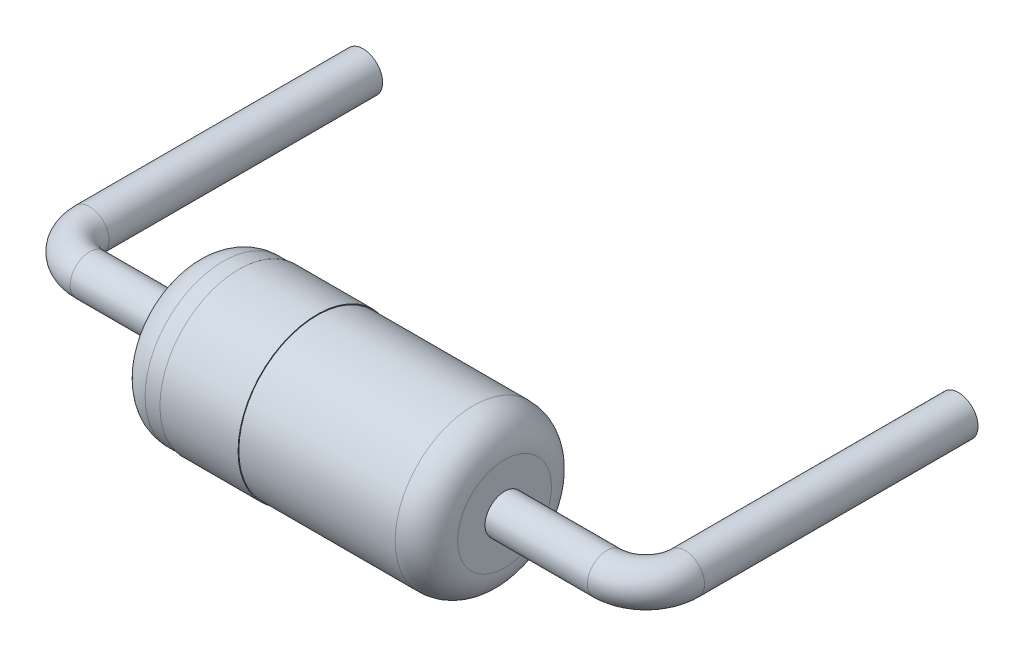
ISO-10303-21;
HEADER;
FILE_DESCRIPTION(('STEP AP214'),'2;1');
FILE_NAME('part.step','',(''),(''),'','','');
FILE_SCHEMA(('AUTOMOTIVE_DESIGN { 1 0 10303 214 1 1 1 1 }'));
ENDSEC;
DATA;
#1=APPLICATION_CONTEXT('core data for automotive mechanical design processes');
#2=APPLICATION_PROTOCOL_DEFINITION('international standard','automotive_design',2000,#1);
#3=PRODUCT_CONTEXT('',#1,'mechanical');
#4=PRODUCT('Part','Part','',(#3));
#5=PRODUCT_RELATED_PRODUCT_CATEGORY('part','',(#4));
#6=PRODUCT_DEFINITION_FORMATION('','',#4);
#7=PRODUCT_DEFINITION_CONTEXT('part definition',#1,'design');
#8=PRODUCT_DEFINITION('design','',#6,#7);
#9=PRODUCT_DEFINITION_SHAPE('','',#8);
#10=(LENGTH_UNIT() NAMED_UNIT(*) SI_UNIT(.MILLI.,.METRE.));
#11=(NAMED_UNIT(*) PLANE_ANGLE_UNIT() SI_UNIT($,.RADIAN.));
#12=(NAMED_UNIT(*) SI_UNIT($,.STERADIAN.) SOLID_ANGLE_UNIT());
#13=UNCERTAINTY_MEASURE_WITH_UNIT(LENGTH_MEASURE(1.E-05),#10,'distance_accuracy_value','');
#14=(GEOMETRIC_REPRESENTATION_CONTEXT(3) GLOBAL_UNCERTAINTY_ASSIGNED_CONTEXT((#13)) GLOBAL_UNIT_ASSIGNED_CONTEXT((#10,
#11,#12)) REPRESENTATION_CONTEXT('',''));
#15=CARTESIAN_POINT('',(0.,0.,0.));
#16=DIRECTION('',(0.,0.,1.));
#17=DIRECTION('',(1.,0.,0.));
#18=AXIS2_PLACEMENT_3D('',#15,#16,#17);
#19=CARTESIAN_POINT('',(7.37,0.,-2.5));
#20=DIRECTION('',(0.,0.,1.));
#21=DIRECTION('',(1.,0.,0.));
#22=AXIS2_PLACEMENT_3D('',#19,#20,#21);
#23=PLANE('',#22);
#24=CARTESIAN_POINT('',(7.62,0.,-2.5));
#25=DIRECTION('',(0.,0.,-1.));
#26=DIRECTION('',(-1.,0.,0.));
#27=AXIS2_PLACEMENT_3D('',#24,#25,#26);
#28=CIRCLE('',#27,0.25);
#29=CARTESIAN_POINT('',(7.37,0.,-2.5));
#30=VERTEX_POINT('',#29);
#31=EDGE_CURVE('P0_E11',#30,#30,#28,.T.);
#32=ORIENTED_EDGE('',*,*,#31,.T.);
#33=EDGE_LOOP('',(#32));
#34=FACE_BOUND('',#33,.T.);
#35=ADVANCED_FACE('P0_F17',(#34),#23,.F.);
#36=CARTESIAN_POINT('',(0.25,0.,-2.5));
#37=DIRECTION('',(0.,0.,-1.));
#38=DIRECTION('',(0.,-1.,0.));
#39=AXIS2_PLACEMENT_3D('',#36,#37,#38);
#40=PLANE('',#39);
#41=CARTESIAN_POINT('',(0.,0.,-2.5));
#42=DIRECTION('',(0.,0.,1.));
#43=DIRECTION('',(1.,0.,0.));
#44=AXIS2_PLACEMENT_3D('',#41,#42,#43);
#45=CIRCLE('',#44,0.25);
#46=CARTESIAN_POINT('',(0.25,0.,-2.5));
#47=VERTEX_POINT('',#46);
#48=EDGE_CURVE('P0_E64',#47,#47,#45,.T.);
#49=ORIENTED_EDGE('',*,*,#48,.F.);
#50=EDGE_LOOP('',(#49));
#51=FACE_BOUND('',#50,.T.);
#52=ADVANCED_FACE('P0_F162',(#51),#40,.T.);
#53=CARTESIAN_POINT('',(7.62,0.,1.));
#54=DIRECTION('',(0.,0.,-1.));
#55=DIRECTION('',(-1.,0.,0.));
#56=AXIS2_PLACEMENT_3D('',#53,#54,#55);
#57=CYLINDRICAL_SURFACE('',#56,0.25);
#58=DIRECTION('',(0.,0.,-1.));
#59=VECTOR('',#58,1.);
#60=CARTESIAN_POINT('',(7.37,0.,1.));
#61=LINE('',#60,#59);
#62=CARTESIAN_POINT('',(7.37,0.,1.));
#63=VERTEX_POINT('',#62);
#64=EDGE_CURVE('P0_E28',#63,#30,#61,.T.);
#65=ORIENTED_EDGE('',*,*,#64,.T.);
#66=ORIENTED_EDGE('',*,*,#31,.F.);
#67=ORIENTED_EDGE('',*,*,#64,.F.);
#68=CARTESIAN_POINT('',(7.62,0.,1.));
#69=DIRECTION('',(0.,0.,1.));
#70=DIRECTION('',(1.,0.,0.));
#71=AXIS2_PLACEMENT_3D('',#68,#69,#70);
#72=CIRCLE('',#71,0.25);
#73=EDGE_CURVE('P0_E89',#63,#63,#72,.T.);
#74=ORIENTED_EDGE('',*,*,#73,.F.);
#75=EDGE_LOOP('',(#65,#66,#67,#74));
#76=FACE_BOUND('',#75,.T.);
#77=ADVANCED_FACE('P0_F168',(#76),#57,.T.);
#78=CARTESIAN_POINT('',(7.12,0.,1.));
#79=DIRECTION('',(0.,1.,0.));
#80=DIRECTION('',(1.,0.,0.));
#81=AXIS2_PLACEMENT_3D('',#78,#79,#80);
#82=TOROIDAL_SURFACE('',#81,0.5,0.25);
#83=CARTESIAN_POINT('',(7.12,0.,1.));
#84=DIRECTION('',(0.,1.,0.));
#85=DIRECTION('',(1.,0.,0.));
#86=AXIS2_PLACEMENT_3D('',#83,#84,#85);
#87=CIRCLE('',#86,0.25);
#88=CARTESIAN_POINT('',(7.12,0.,1.25));
#89=VERTEX_POINT('',#88);
#90=EDGE_CURVE('P0_E88',#89,#63,#87,.T.);
#91=ORIENTED_EDGE('',*,*,#90,.T.);
#92=ORIENTED_EDGE('',*,*,#73,.T.);
#93=ORIENTED_EDGE('',*,*,#90,.F.);
#94=CARTESIAN_POINT('',(7.12,0.,1.5));
#95=DIRECTION('',(1.,0.,0.));
#96=DIRECTION('',(0.,0.,-1.));
#97=AXIS2_PLACEMENT_3D('',#94,#95,#96);
#98=CIRCLE('',#97,0.25);
#99=EDGE_CURVE('P0_E82',#89,#89,#98,.T.);
#100=ORIENTED_EDGE('',*,*,#99,.T.);
#101=EDGE_LOOP('',(#91,#92,#93,#100));
#102=FACE_BOUND('',#101,.T.);
#103=ADVANCED_FACE('P0_F19',(#102),#82,.T.);
#104=CARTESIAN_POINT('',(0.5,0.,1.5));
#105=DIRECTION('',(1.,0.,0.));
#106=DIRECTION('',(0.,0.,-1.));
#107=AXIS2_PLACEMENT_3D('',#104,#105,#106);
#108=CYLINDRICAL_SURFACE('',#107,0.25);
#109=DIRECTION('',(1.,0.,0.));
#110=VECTOR('',#109,1.);
#111=CARTESIAN_POINT('',(0.5,0.,1.25));
#112=LINE('',#111,#110);
#113=CARTESIAN_POINT('',(0.5,0.,1.25));
#114=VERTEX_POINT('',#113);
#115=EDGE_CURVE('P0_E78',#114,#89,#112,.T.);
#116=ORIENTED_EDGE('',*,*,#115,.T.);
#117=ORIENTED_EDGE('',*,*,#99,.F.);
#118=ORIENTED_EDGE('',*,*,#115,.F.);
#119=CARTESIAN_POINT('',(0.5,0.,1.5));
#120=DIRECTION('',(-1.,0.,0.));
#121=DIRECTION('',(0.,0.,1.));
#122=AXIS2_PLACEMENT_3D('',#119,#120,#121);
#123=CIRCLE('',#122,0.25);
#124=EDGE_CURVE('P0_E74',#114,#114,#123,.T.);
#125=ORIENTED_EDGE('',*,*,#124,.F.);
#126=EDGE_LOOP('',(#116,#117,#118,#125));
#127=FACE_BOUND('',#126,.T.);
#128=ADVANCED_FACE('P0_F147',(#127),#108,.T.);
#129=CARTESIAN_POINT('',(0.5,0.,1.));
#130=DIRECTION('',(0.,1.,0.));
#131=DIRECTION('',(1.,0.,0.));
#132=AXIS2_PLACEMENT_3D('',#129,#130,#131);
#133=TOROIDAL_SURFACE('',#132,0.5,0.25);
#134=CARTESIAN_POINT('',(0.5,0.,1.));
#135=DIRECTION('',(0.,1.,0.));
#136=DIRECTION('',(1.,0.,0.));
#137=AXIS2_PLACEMENT_3D('',#134,#135,#136);
#138=CIRCLE('',#137,0.25);
#139=CARTESIAN_POINT('',(0.25,0.,1.));
#140=VERTEX_POINT('',#139);
#141=EDGE_CURVE('P0_E55',#140,#114,#138,.T.);
#142=ORIENTED_EDGE('',*,*,#141,.T.);
#143=ORIENTED_EDGE('',*,*,#124,.T.);
#144=ORIENTED_EDGE('',*,*,#141,.F.);
#145=CARTESIAN_POINT('',(0.,0.,1.));
#146=DIRECTION('',(0.,0.,1.));
#147=DIRECTION('',(1.,0.,0.));
#148=AXIS2_PLACEMENT_3D('',#145,#146,#147);
#149=CIRCLE('',#148,0.25);
#150=EDGE_CURVE('P0_E69',#140,#140,#149,.T.);
#151=ORIENTED_EDGE('',*,*,#150,.T.);
#152=EDGE_LOOP('',(#142,#143,#144,#151));
#153=FACE_BOUND('',#152,.T.);
#154=ADVANCED_FACE('P0_F149',(#153),#133,.T.);
#155=CARTESIAN_POINT('',(0.,0.,1.));
#156=DIRECTION('',(0.,0.,1.));
#157=DIRECTION('',(1.,0.,0.));
#158=AXIS2_PLACEMENT_3D('',#155,#156,#157);
#159=CYLINDRICAL_SURFACE('',#158,0.25);
#160=DIRECTION('',(0.,0.,1.));
#161=VECTOR('',#160,1.);
#162=CARTESIAN_POINT('',(0.25,0.,1.));
#163=LINE('',#162,#161);
#164=EDGE_CURVE('P0_E21',#47,#140,#163,.T.);
#165=ORIENTED_EDGE('',*,*,#164,.T.);
#166=ORIENTED_EDGE('',*,*,#150,.F.);
#167=ORIENTED_EDGE('',*,*,#164,.F.);
#168=ORIENTED_EDGE('',*,*,#48,.T.);
#169=EDGE_LOOP('',(#165,#166,#167,#168));
#170=FACE_BOUND('',#169,.T.);
#171=ADVANCED_FACE('P0_F65',(#170),#159,.T.);
#172=CLOSED_SHELL('',(#35,#52,#77,#103,#128,#154,#171));
#173=MANIFOLD_SOLID_BREP('P0_B1',#172);
#174=CARTESIAN_POINT('',(5.81,0.,1.5));
#175=DIRECTION('',(1.,0.,0.));
#176=DIRECTION('',(0.,1.,0.));
#177=AXIS2_PLACEMENT_3D('',#174,#175,#176);
#178=PLANE('',#177);
#179=CARTESIAN_POINT('',(5.81,0.,1.5));
#180=DIRECTION('',(1.,0.,0.));
#181=DIRECTION('',(0.,0.,1.));
#182=AXIS2_PLACEMENT_3D('',#179,#180,#181);
#183=CIRCLE('',#182,0.6);
#184=CARTESIAN_POINT('',(5.81,0.,2.1));
#185=VERTEX_POINT('',#184);
#186=EDGE_CURVE('P1_E11',#185,#185,#183,.T.);
#187=ORIENTED_EDGE('',*,*,#186,.T.);
#188=EDGE_LOOP('',(#187));
#189=FACE_BOUND('',#188,.T.);
#190=ADVANCED_FACE('P1_F17',(#189),#178,.T.);
#191=CARTESIAN_POINT('',(1.81,0.,1.5));
#192=DIRECTION('',(1.,0.,0.));
#193=DIRECTION('',(0.,1.,0.));
#194=AXIS2_PLACEMENT_3D('',#191,#192,#193);
#195=PLANE('',#194);
#196=CARTESIAN_POINT('',(1.81,0.,1.5));
#197=DIRECTION('',(1.,0.,0.));
#198=DIRECTION('',(0.,0.,1.));
#199=AXIS2_PLACEMENT_3D('',#196,#197,#198);
#200=CIRCLE('',#199,0.6);
#201=CARTESIAN_POINT('',(1.81,0.,2.1));
#202=VERTEX_POINT('',#201);
#203=EDGE_CURVE('P1_E102',#202,#202,#200,.T.);
#204=ORIENTED_EDGE('',*,*,#203,.F.);
#205=EDGE_LOOP('',(#204));
#206=FACE_BOUND('',#205,.T.);
#207=ADVANCED_FACE('P1_F124',(#206),#195,.F.);
#208=CARTESIAN_POINT('',(5.41,0.,1.5));
#209=DIRECTION('',(-1.,0.,0.));
#210=DIRECTION('',(0.,0.,1.));
#211=AXIS2_PLACEMENT_3D('',#208,#209,#210);
#212=TOROIDAL_SURFACE('',#211,0.6,0.4);
#213=CARTESIAN_POINT('',(5.41,0.,1.5));
#214=DIRECTION('',(1.,0.,0.));
#215=DIRECTION('',(0.,0.,1.));
#216=AXIS2_PLACEMENT_3D('',#213,#214,#215);
#217=CIRCLE('',#216,1.);
#218=CARTESIAN_POINT('',(5.41,0.,2.5));
#219=VERTEX_POINT('',#218);
#220=EDGE_CURVE('P1_E101',#219,#219,#217,.T.);
#221=ORIENTED_EDGE('',*,*,#220,.T.);
#222=CARTESIAN_POINT('',(5.41,0.,2.1));
#223=DIRECTION('',(0.,-1.,0.));
#224=DIRECTION('',(0.,0.,1.));
#225=AXIS2_PLACEMENT_3D('',#222,#223,#224);
#226=CIRCLE('',#225,0.4);
#227=EDGE_CURVE('P1_E27',#185,#219,#226,.T.);
#228=ORIENTED_EDGE('',*,*,#227,.F.);
#229=ORIENTED_EDGE('',*,*,#186,.F.);
#230=ORIENTED_EDGE('',*,*,#227,.T.);
#231=EDGE_LOOP('',(#221,#228,#229,#230));
#232=FACE_BOUND('',#231,.T.);
#233=ADVANCED_FACE('P1_F122',(#232),#212,.T.);
#234=CARTESIAN_POINT('',(2.21,0.,1.5));
#235=DIRECTION('',(-1.,0.,0.));
#236=DIRECTION('',(0.,0.,1.));
#237=AXIS2_PLACEMENT_3D('',#234,#235,#236);
#238=TOROIDAL_SURFACE('',#237,0.6,0.4);
#239=ORIENTED_EDGE('',*,*,#203,.T.);
#240=CARTESIAN_POINT('',(2.21,0.,2.1));
#241=DIRECTION('',(0.,-1.,0.));
#242=DIRECTION('',(0.,0.,1.));
#243=AXIS2_PLACEMENT_3D('',#240,#241,#242);
#244=CIRCLE('',#243,0.4);
#245=CARTESIAN_POINT('',(2.21,0.,2.5));
#246=VERTEX_POINT('',#245);
#247=EDGE_CURVE('P1_E48',#246,#202,#244,.T.);
#248=ORIENTED_EDGE('',*,*,#247,.F.);
#249=CARTESIAN_POINT('',(2.21,0.,1.5));
#250=DIRECTION('',(1.,0.,0.));
#251=DIRECTION('',(0.,0.,1.));
#252=AXIS2_PLACEMENT_3D('',#249,#250,#251);
#253=CIRCLE('',#252,1.);
#254=EDGE_CURVE('P1_E82',#246,#246,#253,.T.);
#255=ORIENTED_EDGE('',*,*,#254,.F.);
#256=ORIENTED_EDGE('',*,*,#247,.T.);
#257=EDGE_LOOP('',(#239,#248,#255,#256));
#258=FACE_BOUND('',#257,.T.);
#259=ADVANCED_FACE('P1_F19',(#258),#238,.T.);
#260=CARTESIAN_POINT('',(1.81,0.,1.5));
#261=DIRECTION('',(1.,0.,0.));
#262=DIRECTION('',(0.,0.,1.));
#263=AXIS2_PLACEMENT_3D('',#260,#261,#262);
#264=CYLINDRICAL_SURFACE('',#263,1.);
#265=CARTESIAN_POINT('',(3.41,0.,1.5));
#266=DIRECTION('',(1.,0.,0.));
#267=DIRECTION('',(0.,0.,1.));
#268=AXIS2_PLACEMENT_3D('',#265,#266,#267);
#269=CIRCLE('',#268,1.);
#270=CARTESIAN_POINT('',(3.41,0.,2.5));
#271=VERTEX_POINT('',#270);
#272=EDGE_CURVE('P1_E89',#271,#271,#269,.T.);
#273=ORIENTED_EDGE('',*,*,#272,.T.);
#274=DIRECTION('',(1.,0.,0.));
#275=VECTOR('',#274,1.);
#276=CARTESIAN_POINT('',(1.81,0.,2.5));
#277=LINE('',#276,#275);
#278=EDGE_CURVE('P1_E68',#271,#219,#277,.T.);
#279=ORIENTED_EDGE('',*,*,#278,.T.);
#280=ORIENTED_EDGE('',*,*,#220,.F.);
#281=ORIENTED_EDGE('',*,*,#278,.F.);
#282=EDGE_LOOP('',(#273,#279,#280,#281));
#283=FACE_BOUND('',#282,.T.);
#284=ADVANCED_FACE('P1_F131',(#283),#264,.T.);
#285=CARTESIAN_POINT('',(1.81,0.,1.5));
#286=DIRECTION('',(1.,0.,0.));
#287=DIRECTION('',(0.,0.,1.));
#288=AXIS2_PLACEMENT_3D('',#285,#286,#287);
#289=CYLINDRICAL_SURFACE('',#288,1.);
#290=ORIENTED_EDGE('',*,*,#254,.T.);
#291=DIRECTION('',(1.,0.,0.));
#292=VECTOR('',#291,1.);
#293=CARTESIAN_POINT('',(1.81,0.,2.5));
#294=LINE('',#293,#292);
#295=CARTESIAN_POINT('',(2.41,0.,2.5));
#296=VERTEX_POINT('',#295);
#297=EDGE_CURVE('P1_E78',#246,#296,#294,.T.);
#298=ORIENTED_EDGE('',*,*,#297,.T.);
#299=CARTESIAN_POINT('',(2.41,0.,1.5));
#300=DIRECTION('',(1.,0.,0.));
#301=DIRECTION('',(0.,0.,1.));
#302=AXIS2_PLACEMENT_3D('',#299,#300,#301);
#303=CIRCLE('',#302,1.);
#304=EDGE_CURVE('P1_E81',#296,#296,#303,.T.);
#305=ORIENTED_EDGE('',*,*,#304,.F.);
#306=ORIENTED_EDGE('',*,*,#297,.F.);
#307=EDGE_LOOP('',(#290,#298,#305,#306));
#308=FACE_BOUND('',#307,.T.);
#309=ADVANCED_FACE('P1_F80',(#308),#289,.T.);
#310=CARTESIAN_POINT('',(3.41,0.,1.5));
#311=DIRECTION('',(1.,0.,0.));
#312=DIRECTION('',(0.,1.,0.));
#313=AXIS2_PLACEMENT_3D('',#310,#311,#312);
#314=PLANE('',#313);
#315=ORIENTED_EDGE('',*,*,#272,.F.);
#316=EDGE_LOOP('',(#315));
#317=FACE_BOUND('',#316,.T.);
#318=CARTESIAN_POINT('',(3.41,0.,1.5));
#319=DIRECTION('',(1.,0.,0.));
#320=DIRECTION('',(0.,0.,1.));
#321=AXIS2_PLACEMENT_3D('',#318,#319,#320);
#322=CIRCLE('',#321,1.01);
#323=CARTESIAN_POINT('',(3.41,0.,2.51));
#324=VERTEX_POINT('',#323);
#325=EDGE_CURVE('P1_E90',#324,#324,#322,.T.);
#326=ORIENTED_EDGE('',*,*,#325,.T.);
#327=EDGE_LOOP('',(#326));
#328=FACE_BOUND('',#327,.T.);
#329=ADVANCED_FACE('P1_F143',(#317,#328),#314,.T.);
#330=CARTESIAN_POINT('',(2.41,0.,1.5));
#331=DIRECTION('',(1.,0.,0.));
#332=DIRECTION('',(0.,1.,0.));
#333=AXIS2_PLACEMENT_3D('',#330,#331,#332);
#334=PLANE('',#333);
#335=ORIENTED_EDGE('',*,*,#304,.T.);
#336=EDGE_LOOP('',(#335));
#337=FACE_BOUND('',#336,.T.);
#338=CARTESIAN_POINT('',(2.41,0.,1.5));
#339=DIRECTION('',(1.,0.,0.));
#340=DIRECTION('',(0.,0.,1.));
#341=AXIS2_PLACEMENT_3D('',#338,#339,#340);
#342=CIRCLE('',#341,1.01);
#343=CARTESIAN_POINT('',(2.41,0.,2.51));
#344=VERTEX_POINT('',#343);
#345=EDGE_CURVE('P1_E21',#344,#344,#342,.T.);
#346=ORIENTED_EDGE('',*,*,#345,.F.);
#347=EDGE_LOOP('',(#346));
#348=FACE_BOUND('',#347,.T.);
#349=ADVANCED_FACE('P1_F86',(#337,#348),#334,.F.);
#350=CARTESIAN_POINT('',(2.41,0.,1.5));
#351=DIRECTION('',(1.,0.,0.));
#352=DIRECTION('',(0.,0.,1.));
#353=AXIS2_PLACEMENT_3D('',#350,#351,#352);
#354=CYLINDRICAL_SURFACE('',#353,1.01);
#355=ORIENTED_EDGE('',*,*,#345,.T.);
#356=DIRECTION('',(1.,0.,0.));
#357=VECTOR('',#356,1.);
#358=CARTESIAN_POINT('',(2.41,0.,2.51));
#359=LINE('',#358,#357);
#360=EDGE_CURVE('P1_E97',#344,#324,#359,.T.);
#361=ORIENTED_EDGE('',*,*,#360,.T.);
#362=ORIENTED_EDGE('',*,*,#325,.F.);
#363=ORIENTED_EDGE('',*,*,#360,.F.);
#364=EDGE_LOOP('',(#355,#361,#362,#363));
#365=FACE_BOUND('',#364,.T.);
#366=ADVANCED_FACE('P1_F148',(#365),#354,.T.);
#367=CLOSED_SHELL('',(#190,#207,#233,#259,#284,#309,#329,#349,#366));
#368=MANIFOLD_SOLID_BREP('P1_B1',#367);
#369=ADVANCED_BREP_SHAPE_REPRESENTATION('',(#18,#173,#368),#14);
#370=SHAPE_DEFINITION_REPRESENTATION(#9,#369);
ENDSEC;
END-ISO-10303-21;
